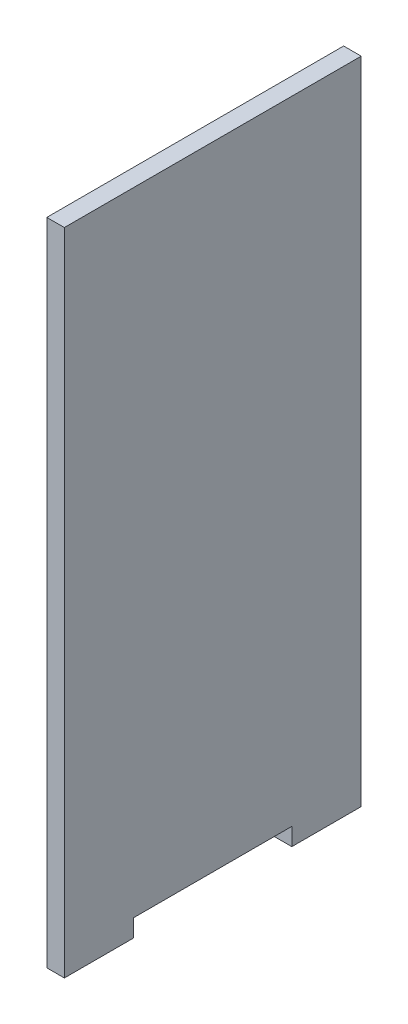
ISO-10303-21;
HEADER;
FILE_DESCRIPTION(('STEP AP214'),'2;1');
FILE_NAME('part.step','',(''),(''),'','','');
FILE_SCHEMA(('AUTOMOTIVE_DESIGN { 1 0 10303 214 1 1 1 1 }'));
ENDSEC;
DATA;
#1=APPLICATION_CONTEXT('core data for automotive mechanical design processes');
#2=APPLICATION_PROTOCOL_DEFINITION('international standard','automotive_design',2000,#1);
#3=PRODUCT_CONTEXT('',#1,'mechanical');
#4=PRODUCT('Part','Part','',(#3));
#5=PRODUCT_RELATED_PRODUCT_CATEGORY('part','',(#4));
#6=PRODUCT_DEFINITION_FORMATION('','',#4);
#7=PRODUCT_DEFINITION_CONTEXT('part definition',#1,'design');
#8=PRODUCT_DEFINITION('design','',#6,#7);
#9=PRODUCT_DEFINITION_SHAPE('','',#8);
#10=(LENGTH_UNIT() NAMED_UNIT(*) SI_UNIT(.MILLI.,.METRE.));
#11=(NAMED_UNIT(*) PLANE_ANGLE_UNIT() SI_UNIT($,.RADIAN.));
#12=(NAMED_UNIT(*) SI_UNIT($,.STERADIAN.) SOLID_ANGLE_UNIT());
#13=UNCERTAINTY_MEASURE_WITH_UNIT(LENGTH_MEASURE(1.E-05),#10,'distance_accuracy_value','');
#14=(GEOMETRIC_REPRESENTATION_CONTEXT(3) GLOBAL_UNCERTAINTY_ASSIGNED_CONTEXT((#13)) GLOBAL_UNIT_ASSIGNED_CONTEXT((#10,
#11,#12)) REPRESENTATION_CONTEXT('',''));
#15=CARTESIAN_POINT('',(0.,0.,0.));
#16=DIRECTION('',(0.,0.,1.));
#17=DIRECTION('',(1.,0.,0.));
#18=AXIS2_PLACEMENT_3D('',#15,#16,#17);
#19=CARTESIAN_POINT('',(5.,0.,42.25));
#20=DIRECTION('',(0.,0.,-1.));
#21=DIRECTION('',(-1.,0.,0.));
#22=AXIS2_PLACEMENT_3D('',#19,#20,#21);
#23=PLANE('',#22);
#24=DIRECTION('',(0.,-1.,0.));
#25=VECTOR('',#24,1.);
#26=CARTESIAN_POINT('',(0.,0.,42.25));
#27=LINE('',#26,#25);
#28=CARTESIAN_POINT('',(0.,180.,42.25));
#29=VERTEX_POINT('',#28);
#30=CARTESIAN_POINT('',(0.,-5.,42.25));
#31=VERTEX_POINT('',#30);
#32=EDGE_CURVE('E84',#29,#31,#27,.T.);
#33=ORIENTED_EDGE('',*,*,#32,.T.);
#34=DIRECTION('',(-1.,0.,0.));
#35=VECTOR('',#34,1.);
#36=CARTESIAN_POINT('',(5.,-5.,42.25));
#37=LINE('',#36,#35);
#38=CARTESIAN_POINT('',(5.,-5.,42.25));
#39=VERTEX_POINT('',#38);
#40=EDGE_CURVE('E11',#39,#31,#37,.T.);
#41=ORIENTED_EDGE('',*,*,#40,.F.);
#42=DIRECTION('',(0.,-1.,0.));
#43=VECTOR('',#42,1.);
#44=CARTESIAN_POINT('',(5.,180.,42.25));
#45=LINE('',#44,#43);
#46=CARTESIAN_POINT('',(5.,180.,42.25));
#47=VERTEX_POINT('',#46);
#48=EDGE_CURVE('E90',#47,#39,#45,.T.);
#49=ORIENTED_EDGE('',*,*,#48,.F.);
#50=DIRECTION('',(-1.,0.,0.));
#51=VECTOR('',#50,1.);
#52=CARTESIAN_POINT('',(5.,180.,42.25));
#53=LINE('',#52,#51);
#54=EDGE_CURVE('E125',#47,#29,#53,.T.);
#55=ORIENTED_EDGE('',*,*,#54,.T.);
#56=EDGE_LOOP('',(#33,#41,#49,#55));
#57=FACE_BOUND('',#56,.T.);
#58=ADVANCED_FACE('F33',(#57),#23,.F.);
#59=CARTESIAN_POINT('',(5.,-5.,42.25));
#60=DIRECTION('',(0.,1.,0.));
#61=DIRECTION('',(0.,0.,1.));
#62=AXIS2_PLACEMENT_3D('',#59,#60,#61);
#63=PLANE('',#62);
#64=DIRECTION('',(0.,0.,-1.));
#65=VECTOR('',#64,1.);
#66=CARTESIAN_POINT('',(0.,-5.,42.25));
#67=LINE('',#66,#65);
#68=CARTESIAN_POINT('',(0.,-5.,22.5));
#69=VERTEX_POINT('',#68);
#70=EDGE_CURVE('E130',#31,#69,#67,.T.);
#71=ORIENTED_EDGE('',*,*,#70,.T.);
#72=DIRECTION('',(-1.,0.,0.));
#73=VECTOR('',#72,1.);
#74=CARTESIAN_POINT('',(5.,-5.,22.5));
#75=LINE('',#74,#73);
#76=CARTESIAN_POINT('',(5.,-5.,22.5));
#77=VERTEX_POINT('',#76);
#78=EDGE_CURVE('E41',#77,#69,#75,.T.);
#79=ORIENTED_EDGE('',*,*,#78,.F.);
#80=DIRECTION('',(0.,0.,-1.));
#81=VECTOR('',#80,1.);
#82=CARTESIAN_POINT('',(5.,-5.,42.25));
#83=LINE('',#82,#81);
#84=EDGE_CURVE('E174',#39,#77,#83,.T.);
#85=ORIENTED_EDGE('',*,*,#84,.F.);
#86=ORIENTED_EDGE('',*,*,#40,.T.);
#87=EDGE_LOOP('',(#71,#79,#85,#86));
#88=FACE_BOUND('',#87,.T.);
#89=ADVANCED_FACE('F176',(#88),#63,.F.);
#90=CARTESIAN_POINT('',(5.,-5.,22.5));
#91=DIRECTION('',(0.,0.,1.));
#92=DIRECTION('',(1.,0.,0.));
#93=AXIS2_PLACEMENT_3D('',#90,#91,#92);
#94=PLANE('',#93);
#95=DIRECTION('',(0.,1.,0.));
#96=VECTOR('',#95,1.);
#97=CARTESIAN_POINT('',(0.,-5.,22.5));
#98=LINE('',#97,#96);
#99=CARTESIAN_POINT('',(0.,0.,22.5));
#100=VERTEX_POINT('',#99);
#101=EDGE_CURVE('E132',#69,#100,#98,.T.);
#102=ORIENTED_EDGE('',*,*,#101,.T.);
#103=DIRECTION('',(-1.,0.,0.));
#104=VECTOR('',#103,1.);
#105=CARTESIAN_POINT('',(5.,0.,22.5));
#106=LINE('',#105,#104);
#107=CARTESIAN_POINT('',(5.,0.,22.5));
#108=VERTEX_POINT('',#107);
#109=EDGE_CURVE('E149',#108,#100,#106,.T.);
#110=ORIENTED_EDGE('',*,*,#109,.F.);
#111=DIRECTION('',(0.,1.,0.));
#112=VECTOR('',#111,1.);
#113=CARTESIAN_POINT('',(5.,-5.,22.5));
#114=LINE('',#113,#112);
#115=EDGE_CURVE('E158',#77,#108,#114,.T.);
#116=ORIENTED_EDGE('',*,*,#115,.F.);
#117=ORIENTED_EDGE('',*,*,#78,.T.);
#118=EDGE_LOOP('',(#102,#110,#116,#117));
#119=FACE_BOUND('',#118,.T.);
#120=ADVANCED_FACE('F156',(#119),#94,.F.);
#121=CARTESIAN_POINT('',(5.,0.,22.5));
#122=DIRECTION('',(0.,1.,0.));
#123=DIRECTION('',(0.,0.,1.));
#124=AXIS2_PLACEMENT_3D('',#121,#122,#123);
#125=PLANE('',#124);
#126=DIRECTION('',(0.,0.,-1.));
#127=VECTOR('',#126,1.);
#128=CARTESIAN_POINT('',(0.,0.,22.5));
#129=LINE('',#128,#127);
#130=CARTESIAN_POINT('',(0.,0.,-22.5));
#131=VERTEX_POINT('',#130);
#132=EDGE_CURVE('E134',#100,#131,#129,.T.);
#133=ORIENTED_EDGE('',*,*,#132,.T.);
#134=DIRECTION('',(-1.,0.,0.));
#135=VECTOR('',#134,1.);
#136=CARTESIAN_POINT('',(5.,0.,-22.5));
#137=LINE('',#136,#135);
#138=CARTESIAN_POINT('',(5.,0.,-22.5));
#139=VERTEX_POINT('',#138);
#140=EDGE_CURVE('E146',#139,#131,#137,.T.);
#141=ORIENTED_EDGE('',*,*,#140,.F.);
#142=DIRECTION('',(0.,0.,-1.));
#143=VECTOR('',#142,1.);
#144=CARTESIAN_POINT('',(5.,0.,22.5));
#145=LINE('',#144,#143);
#146=EDGE_CURVE('E170',#108,#139,#145,.T.);
#147=ORIENTED_EDGE('',*,*,#146,.F.);
#148=ORIENTED_EDGE('',*,*,#109,.T.);
#149=EDGE_LOOP('',(#133,#141,#147,#148));
#150=FACE_BOUND('',#149,.T.);
#151=ADVANCED_FACE('F166',(#150),#125,.F.);
#152=CARTESIAN_POINT('',(5.,-4.99999999999999,-22.5));
#153=DIRECTION('',(0.,0.,-1.));
#154=DIRECTION('',(-1.,0.,0.));
#155=AXIS2_PLACEMENT_3D('',#152,#153,#154);
#156=PLANE('',#155);
#157=DIRECTION('',(0.,-1.,0.));
#158=VECTOR('',#157,1.);
#159=CARTESIAN_POINT('',(0.,-4.99999999999999,-22.5));
#160=LINE('',#159,#158);
#161=CARTESIAN_POINT('',(0.,-4.99999999999999,-22.5));
#162=VERTEX_POINT('',#161);
#163=EDGE_CURVE('E136',#131,#162,#160,.T.);
#164=ORIENTED_EDGE('',*,*,#163,.T.);
#165=DIRECTION('',(-1.,0.,0.));
#166=VECTOR('',#165,1.);
#167=CARTESIAN_POINT('',(5.,-4.99999999999999,-22.5));
#168=LINE('',#167,#166);
#169=CARTESIAN_POINT('',(5.,-4.99999999999999,-22.5));
#170=VERTEX_POINT('',#169);
#171=EDGE_CURVE('E120',#170,#162,#168,.T.);
#172=ORIENTED_EDGE('',*,*,#171,.F.);
#173=DIRECTION('',(0.,-1.,0.));
#174=VECTOR('',#173,1.);
#175=CARTESIAN_POINT('',(5.,-4.99999999999999,-22.5));
#176=LINE('',#175,#174);
#177=EDGE_CURVE('E110',#139,#170,#176,.T.);
#178=ORIENTED_EDGE('',*,*,#177,.F.);
#179=ORIENTED_EDGE('',*,*,#140,.T.);
#180=EDGE_LOOP('',(#164,#172,#178,#179));
#181=FACE_BOUND('',#180,.T.);
#182=ADVANCED_FACE('F169',(#181),#156,.F.);
#183=CARTESIAN_POINT('',(5.,-4.99999999999999,-42.25));
#184=DIRECTION('',(0.,1.,0.));
#185=DIRECTION('',(0.,0.,1.));
#186=AXIS2_PLACEMENT_3D('',#183,#184,#185);
#187=PLANE('',#186);
#188=DIRECTION('',(0.,0.,-1.));
#189=VECTOR('',#188,1.);
#190=CARTESIAN_POINT('',(0.,-4.99999999999999,-42.25));
#191=LINE('',#190,#189);
#192=CARTESIAN_POINT('',(0.,-4.99999999999999,-42.25));
#193=VERTEX_POINT('',#192);
#194=EDGE_CURVE('E119',#162,#193,#191,.T.);
#195=ORIENTED_EDGE('',*,*,#194,.T.);
#196=DIRECTION('',(-1.,0.,0.));
#197=VECTOR('',#196,1.);
#198=CARTESIAN_POINT('',(5.,-4.99999999999999,-42.25));
#199=LINE('',#198,#197);
#200=CARTESIAN_POINT('',(5.,-4.99999999999999,-42.25));
#201=VERTEX_POINT('',#200);
#202=EDGE_CURVE('E116',#201,#193,#199,.T.);
#203=ORIENTED_EDGE('',*,*,#202,.F.);
#204=DIRECTION('',(0.,0.,-1.));
#205=VECTOR('',#204,1.);
#206=CARTESIAN_POINT('',(5.,-4.99999999999999,-42.25));
#207=LINE('',#206,#205);
#208=EDGE_CURVE('E104',#170,#201,#207,.T.);
#209=ORIENTED_EDGE('',*,*,#208,.F.);
#210=ORIENTED_EDGE('',*,*,#171,.T.);
#211=EDGE_LOOP('',(#195,#203,#209,#210));
#212=FACE_BOUND('',#211,.T.);
#213=ADVANCED_FACE('F117',(#212),#187,.F.);
#214=CARTESIAN_POINT('',(5.,180.,-42.25));
#215=DIRECTION('',(0.,0.,1.));
#216=DIRECTION('',(0.,-1.,0.));
#217=AXIS2_PLACEMENT_3D('',#214,#215,#216);
#218=PLANE('',#217);
#219=DIRECTION('',(0.,1.,0.));
#220=VECTOR('',#219,1.);
#221=CARTESIAN_POINT('',(0.,180.,-42.25));
#222=LINE('',#221,#220);
#223=CARTESIAN_POINT('',(0.,180.,-42.25));
#224=VERTEX_POINT('',#223);
#225=EDGE_CURVE('E77',#193,#224,#222,.T.);
#226=ORIENTED_EDGE('',*,*,#225,.T.);
#227=DIRECTION('',(-1.,0.,0.));
#228=VECTOR('',#227,1.);
#229=CARTESIAN_POINT('',(5.,180.,-42.25));
#230=LINE('',#229,#228);
#231=CARTESIAN_POINT('',(5.,180.,-42.25));
#232=VERTEX_POINT('',#231);
#233=EDGE_CURVE('E121',#232,#224,#230,.T.);
#234=ORIENTED_EDGE('',*,*,#233,.F.);
#235=DIRECTION('',(0.,1.,0.));
#236=VECTOR('',#235,1.);
#237=CARTESIAN_POINT('',(5.,0.,-42.25));
#238=LINE('',#237,#236);
#239=EDGE_CURVE('E108',#201,#232,#238,.T.);
#240=ORIENTED_EDGE('',*,*,#239,.F.);
#241=ORIENTED_EDGE('',*,*,#202,.T.);
#242=EDGE_LOOP('',(#226,#234,#240,#241));
#243=FACE_BOUND('',#242,.T.);
#244=ADVANCED_FACE('F123',(#243),#218,.F.);
#245=CARTESIAN_POINT('',(5.,180.,42.25));
#246=DIRECTION('',(0.,-1.,0.));
#247=DIRECTION('',(0.,0.,-1.));
#248=AXIS2_PLACEMENT_3D('',#245,#246,#247);
#249=PLANE('',#248);
#250=DIRECTION('',(0.,0.,1.));
#251=VECTOR('',#250,1.);
#252=CARTESIAN_POINT('',(0.,180.,42.25));
#253=LINE('',#252,#251);
#254=EDGE_CURVE('E140',#224,#29,#253,.T.);
#255=ORIENTED_EDGE('',*,*,#254,.T.);
#256=ORIENTED_EDGE('',*,*,#54,.F.);
#257=DIRECTION('',(0.,0.,1.));
#258=VECTOR('',#257,1.);
#259=CARTESIAN_POINT('',(5.,180.,42.25));
#260=LINE('',#259,#258);
#261=EDGE_CURVE('E49',#232,#47,#260,.T.);
#262=ORIENTED_EDGE('',*,*,#261,.F.);
#263=ORIENTED_EDGE('',*,*,#233,.T.);
#264=EDGE_LOOP('',(#255,#256,#262,#263));
#265=FACE_BOUND('',#264,.T.);
#266=ADVANCED_FACE('F179',(#265),#249,.F.);
#267=CARTESIAN_POINT('',(5.,0.,0.));
#268=DIRECTION('',(1.,0.,0.));
#269=DIRECTION('',(0.,0.,-1.));
#270=AXIS2_PLACEMENT_3D('',#267,#268,#269);
#271=PLANE('',#270);
#272=ORIENTED_EDGE('',*,*,#48,.T.);
#273=ORIENTED_EDGE('',*,*,#84,.T.);
#274=ORIENTED_EDGE('',*,*,#115,.T.);
#275=ORIENTED_EDGE('',*,*,#146,.T.);
#276=ORIENTED_EDGE('',*,*,#177,.T.);
#277=ORIENTED_EDGE('',*,*,#208,.T.);
#278=ORIENTED_EDGE('',*,*,#239,.T.);
#279=ORIENTED_EDGE('',*,*,#261,.T.);
#280=EDGE_LOOP('',(#272,#273,#274,#275,#276,#277,#278,#279));
#281=FACE_BOUND('',#280,.T.);
#282=ADVANCED_FACE('F106',(#281),#271,.T.);
#283=CARTESIAN_POINT('',(0.,0.,0.));
#284=DIRECTION('',(1.,0.,0.));
#285=DIRECTION('',(0.,0.,-1.));
#286=AXIS2_PLACEMENT_3D('',#283,#284,#285);
#287=PLANE('',#286);
#288=ORIENTED_EDGE('',*,*,#32,.F.);
#289=ORIENTED_EDGE('',*,*,#254,.F.);
#290=ORIENTED_EDGE('',*,*,#225,.F.);
#291=ORIENTED_EDGE('',*,*,#194,.F.);
#292=ORIENTED_EDGE('',*,*,#163,.F.);
#293=ORIENTED_EDGE('',*,*,#132,.F.);
#294=ORIENTED_EDGE('',*,*,#101,.F.);
#295=ORIENTED_EDGE('',*,*,#70,.F.);
#296=EDGE_LOOP('',(#288,#289,#290,#291,#292,#293,#294,#295));
#297=FACE_BOUND('',#296,.T.);
#298=ADVANCED_FACE('F162',(#297),#287,.F.);
#299=CLOSED_SHELL('',(#58,#89,#120,#151,#182,#213,#244,#266,#282,#298));
#300=MANIFOLD_SOLID_BREP('B2',#299);
#301=ADVANCED_BREP_SHAPE_REPRESENTATION('',(#18,#300),#14);
#302=SHAPE_DEFINITION_REPRESENTATION(#9,#301);
ENDSEC;
END-ISO-10303-21;
